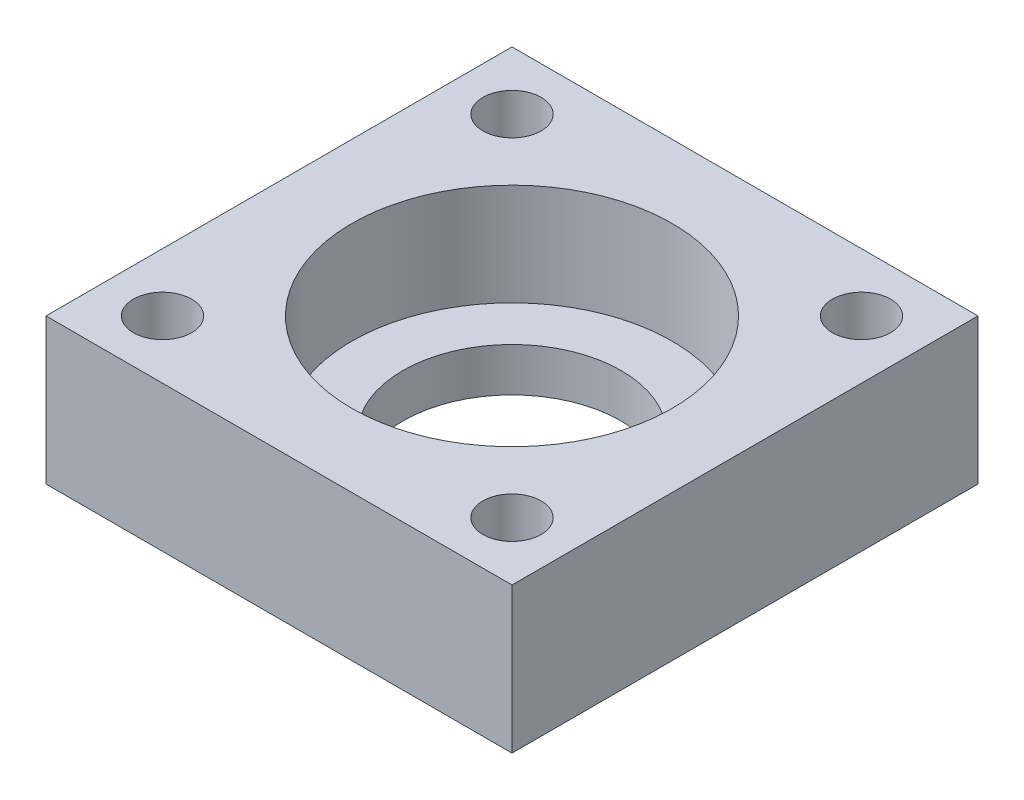
ISO-10303-21;
HEADER;
FILE_DESCRIPTION(('STEP AP214'),'2;1');
FILE_NAME('part.step','',(''),(''),'','','');
FILE_SCHEMA(('AUTOMOTIVE_DESIGN { 1 0 10303 214 1 1 1 1 }'));
ENDSEC;
DATA;
#1=APPLICATION_CONTEXT('core data for automotive mechanical design processes');
#2=APPLICATION_PROTOCOL_DEFINITION('international standard','automotive_design',2000,#1);
#3=PRODUCT_CONTEXT('',#1,'mechanical');
#4=PRODUCT('Part','Part','',(#3));
#5=PRODUCT_RELATED_PRODUCT_CATEGORY('part','',(#4));
#6=PRODUCT_DEFINITION_FORMATION('','',#4);
#7=PRODUCT_DEFINITION_CONTEXT('part definition',#1,'design');
#8=PRODUCT_DEFINITION('design','',#6,#7);
#9=PRODUCT_DEFINITION_SHAPE('','',#8);
#10=(LENGTH_UNIT() NAMED_UNIT(*) SI_UNIT(.MILLI.,.METRE.));
#11=(NAMED_UNIT(*) PLANE_ANGLE_UNIT() SI_UNIT($,.RADIAN.));
#12=(NAMED_UNIT(*) SI_UNIT($,.STERADIAN.) SOLID_ANGLE_UNIT());
#13=UNCERTAINTY_MEASURE_WITH_UNIT(LENGTH_MEASURE(1.E-05),#10,'distance_accuracy_value','');
#14=(GEOMETRIC_REPRESENTATION_CONTEXT(3) GLOBAL_UNCERTAINTY_ASSIGNED_CONTEXT((#13)) GLOBAL_UNIT_ASSIGNED_CONTEXT((#10,
#11,#12)) REPRESENTATION_CONTEXT('',''));
#15=CARTESIAN_POINT('',(0.,0.,0.));
#16=DIRECTION('',(0.,0.,1.));
#17=DIRECTION('',(1.,0.,0.));
#18=AXIS2_PLACEMENT_3D('',#15,#16,#17);
#19=CARTESIAN_POINT('',(16.,10.,16.));
#20=DIRECTION('',(-1.,0.,0.));
#21=DIRECTION('',(0.,0.,1.));
#22=AXIS2_PLACEMENT_3D('',#19,#20,#21);
#23=PLANE('',#22);
#24=DIRECTION('',(0.,0.,-1.));
#25=VECTOR('',#24,1.);
#26=CARTESIAN_POINT('',(16.,0.,16.));
#27=LINE('',#26,#25);
#28=CARTESIAN_POINT('',(16.,0.,16.));
#29=VERTEX_POINT('',#28);
#30=CARTESIAN_POINT('',(16.,0.,-16.));
#31=VERTEX_POINT('',#30);
#32=EDGE_CURVE('E109',#29,#31,#27,.T.);
#33=ORIENTED_EDGE('',*,*,#32,.T.);
#34=DIRECTION('',(0.,-1.,0.));
#35=VECTOR('',#34,1.);
#36=CARTESIAN_POINT('',(16.,10.,-16.));
#37=LINE('',#36,#35);
#38=CARTESIAN_POINT('',(16.,10.,-16.));
#39=VERTEX_POINT('',#38);
#40=EDGE_CURVE('E11',#39,#31,#37,.T.);
#41=ORIENTED_EDGE('',*,*,#40,.F.);
#42=DIRECTION('',(0.,0.,-1.));
#43=VECTOR('',#42,1.);
#44=CARTESIAN_POINT('',(16.,10.,16.));
#45=LINE('',#44,#43);
#46=CARTESIAN_POINT('',(16.,10.,16.));
#47=VERTEX_POINT('',#46);
#48=EDGE_CURVE('E92',#47,#39,#45,.T.);
#49=ORIENTED_EDGE('',*,*,#48,.F.);
#50=DIRECTION('',(0.,-1.,0.));
#51=VECTOR('',#50,1.);
#52=CARTESIAN_POINT('',(16.,10.,16.));
#53=LINE('',#52,#51);
#54=EDGE_CURVE('E105',#47,#29,#53,.T.);
#55=ORIENTED_EDGE('',*,*,#54,.T.);
#56=EDGE_LOOP('',(#33,#41,#49,#55));
#57=FACE_BOUND('',#56,.T.);
#58=ADVANCED_FACE('F39',(#57),#23,.F.);
#59=CARTESIAN_POINT('',(-16.,10.,-16.));
#60=DIRECTION('',(0.,0.,1.));
#61=DIRECTION('',(1.,0.,0.));
#62=AXIS2_PLACEMENT_3D('',#59,#60,#61);
#63=PLANE('',#62);
#64=DIRECTION('',(-1.,0.,0.));
#65=VECTOR('',#64,1.);
#66=CARTESIAN_POINT('',(-16.,0.,-16.));
#67=LINE('',#66,#65);
#68=CARTESIAN_POINT('',(-16.,0.,-16.));
#69=VERTEX_POINT('',#68);
#70=EDGE_CURVE('E97',#31,#69,#67,.T.);
#71=ORIENTED_EDGE('',*,*,#70,.T.);
#72=DIRECTION('',(0.,-1.,0.));
#73=VECTOR('',#72,1.);
#74=CARTESIAN_POINT('',(-16.,10.,-16.));
#75=LINE('',#74,#73);
#76=CARTESIAN_POINT('',(-16.,10.,-16.));
#77=VERTEX_POINT('',#76);
#78=EDGE_CURVE('E49',#77,#69,#75,.T.);
#79=ORIENTED_EDGE('',*,*,#78,.F.);
#80=DIRECTION('',(-1.,0.,0.));
#81=VECTOR('',#80,1.);
#82=CARTESIAN_POINT('',(-16.,10.,-16.));
#83=LINE('',#82,#81);
#84=EDGE_CURVE('E87',#39,#77,#83,.T.);
#85=ORIENTED_EDGE('',*,*,#84,.F.);
#86=ORIENTED_EDGE('',*,*,#40,.T.);
#87=EDGE_LOOP('',(#71,#79,#85,#86));
#88=FACE_BOUND('',#87,.T.);
#89=ADVANCED_FACE('F96',(#88),#63,.F.);
#90=CARTESIAN_POINT('',(-16.,10.,16.));
#91=DIRECTION('',(1.,0.,0.));
#92=DIRECTION('',(0.,0.,-1.));
#93=AXIS2_PLACEMENT_3D('',#90,#91,#92);
#94=PLANE('',#93);
#95=DIRECTION('',(0.,0.,1.));
#96=VECTOR('',#95,1.);
#97=CARTESIAN_POINT('',(-16.,0.,16.));
#98=LINE('',#97,#96);
#99=CARTESIAN_POINT('',(-16.,0.,16.));
#100=VERTEX_POINT('',#99);
#101=EDGE_CURVE('E74',#69,#100,#98,.T.);
#102=ORIENTED_EDGE('',*,*,#101,.T.);
#103=DIRECTION('',(0.,-1.,0.));
#104=VECTOR('',#103,1.);
#105=CARTESIAN_POINT('',(-16.,10.,16.));
#106=LINE('',#105,#104);
#107=CARTESIAN_POINT('',(-16.,10.,16.));
#108=VERTEX_POINT('',#107);
#109=EDGE_CURVE('E99',#108,#100,#106,.T.);
#110=ORIENTED_EDGE('',*,*,#109,.F.);
#111=DIRECTION('',(0.,0.,1.));
#112=VECTOR('',#111,1.);
#113=CARTESIAN_POINT('',(-16.,10.,16.));
#114=LINE('',#113,#112);
#115=EDGE_CURVE('E90',#77,#108,#114,.T.);
#116=ORIENTED_EDGE('',*,*,#115,.F.);
#117=ORIENTED_EDGE('',*,*,#78,.T.);
#118=EDGE_LOOP('',(#102,#110,#116,#117));
#119=FACE_BOUND('',#118,.T.);
#120=ADVANCED_FACE('F101',(#119),#94,.F.);
#121=CARTESIAN_POINT('',(-16.,10.,16.));
#122=DIRECTION('',(0.,0.,-1.));
#123=DIRECTION('',(-1.,0.,0.));
#124=AXIS2_PLACEMENT_3D('',#121,#122,#123);
#125=PLANE('',#124);
#126=DIRECTION('',(1.,0.,0.));
#127=VECTOR('',#126,1.);
#128=CARTESIAN_POINT('',(-16.,0.,16.));
#129=LINE('',#128,#127);
#130=EDGE_CURVE('E80',#100,#29,#129,.T.);
#131=ORIENTED_EDGE('',*,*,#130,.T.);
#132=ORIENTED_EDGE('',*,*,#54,.F.);
#133=DIRECTION('',(1.,0.,0.));
#134=VECTOR('',#133,1.);
#135=CARTESIAN_POINT('',(-16.,10.,16.));
#136=LINE('',#135,#134);
#137=EDGE_CURVE('E57',#108,#47,#136,.T.);
#138=ORIENTED_EDGE('',*,*,#137,.F.);
#139=ORIENTED_EDGE('',*,*,#109,.T.);
#140=EDGE_LOOP('',(#131,#132,#138,#139));
#141=FACE_BOUND('',#140,.T.);
#142=ADVANCED_FACE('F123',(#141),#125,.F.);
#143=CARTESIAN_POINT('',(0.,10.,0.));
#144=DIRECTION('',(0.,-1.,0.));
#145=DIRECTION('',(0.,0.,-1.));
#146=AXIS2_PLACEMENT_3D('',#143,#144,#145);
#147=PLANE('',#146);
#148=CARTESIAN_POINT('',(-12.,10.,12.));
#149=DIRECTION('',(0.,1.,0.));
#150=DIRECTION('',(0.,0.,-1.));
#151=AXIS2_PLACEMENT_3D('',#148,#149,#150);
#152=CIRCLE('',#151,2.);
#153=CARTESIAN_POINT('',(-12.,10.,10.));
#154=VERTEX_POINT('',#153);
#155=EDGE_CURVE('E150',#154,#154,#152,.T.);
#156=ORIENTED_EDGE('',*,*,#155,.F.);
#157=EDGE_LOOP('',(#156));
#158=FACE_BOUND('',#157,.T.);
#159=CARTESIAN_POINT('',(12.,10.,12.));
#160=DIRECTION('',(0.,1.,0.));
#161=DIRECTION('',(0.,0.,1.));
#162=AXIS2_PLACEMENT_3D('',#159,#160,#161);
#163=CIRCLE('',#162,2.);
#164=CARTESIAN_POINT('',(12.,10.,14.));
#165=VERTEX_POINT('',#164);
#166=EDGE_CURVE('E158',#165,#165,#163,.T.);
#167=ORIENTED_EDGE('',*,*,#166,.F.);
#168=EDGE_LOOP('',(#167));
#169=FACE_BOUND('',#168,.T.);
#170=CARTESIAN_POINT('',(12.,10.,-12.));
#171=DIRECTION('',(0.,1.,0.));
#172=DIRECTION('',(0.,0.,-1.));
#173=AXIS2_PLACEMENT_3D('',#170,#171,#172);
#174=CIRCLE('',#173,2.);
#175=CARTESIAN_POINT('',(12.,10.,-14.));
#176=VERTEX_POINT('',#175);
#177=EDGE_CURVE('E166',#176,#176,#174,.T.);
#178=ORIENTED_EDGE('',*,*,#177,.F.);
#179=EDGE_LOOP('',(#178));
#180=FACE_BOUND('',#179,.T.);
#181=CARTESIAN_POINT('',(-12.,10.,-12.));
#182=DIRECTION('',(0.,1.,0.));
#183=DIRECTION('',(0.,0.,1.));
#184=AXIS2_PLACEMENT_3D('',#181,#182,#183);
#185=CIRCLE('',#184,2.);
#186=CARTESIAN_POINT('',(-12.,10.,-10.));
#187=VERTEX_POINT('',#186);
#188=EDGE_CURVE('E137',#187,#187,#185,.T.);
#189=ORIENTED_EDGE('',*,*,#188,.F.);
#190=EDGE_LOOP('',(#189));
#191=FACE_BOUND('',#190,.T.);
#192=CARTESIAN_POINT('',(0.,10.,0.));
#193=DIRECTION('',(0.,1.,0.));
#194=DIRECTION('',(0.,0.,1.));
#195=AXIS2_PLACEMENT_3D('',#192,#193,#194);
#196=CIRCLE('',#195,11.);
#197=CARTESIAN_POINT('',(0.,10.,11.));
#198=VERTEX_POINT('',#197);
#199=EDGE_CURVE('E130',#198,#198,#196,.T.);
#200=ORIENTED_EDGE('',*,*,#199,.F.);
#201=EDGE_LOOP('',(#200));
#202=FACE_BOUND('',#201,.T.);
#203=ORIENTED_EDGE('',*,*,#48,.T.);
#204=ORIENTED_EDGE('',*,*,#84,.T.);
#205=ORIENTED_EDGE('',*,*,#115,.T.);
#206=ORIENTED_EDGE('',*,*,#137,.T.);
#207=EDGE_LOOP('',(#203,#204,#205,#206));
#208=FACE_BOUND('',#207,.T.);
#209=ADVANCED_FACE('F88',(#158,#169,#180,#191,#202,#208),#147,.F.);
#210=CARTESIAN_POINT('',(0.,0.,0.));
#211=DIRECTION('',(0.,-1.,0.));
#212=DIRECTION('',(0.,0.,-1.));
#213=AXIS2_PLACEMENT_3D('',#210,#211,#212);
#214=PLANE('',#213);
#215=CARTESIAN_POINT('',(0.,0.,0.));
#216=DIRECTION('',(0.,1.,0.));
#217=DIRECTION('',(0.,0.,1.));
#218=AXIS2_PLACEMENT_3D('',#215,#216,#217);
#219=CIRCLE('',#218,7.5);
#220=CARTESIAN_POINT('',(0.,0.,7.5));
#221=VERTEX_POINT('',#220);
#222=EDGE_CURVE('E146',#221,#221,#219,.T.);
#223=ORIENTED_EDGE('',*,*,#222,.T.);
#224=EDGE_LOOP('',(#223));
#225=FACE_BOUND('',#224,.T.);
#226=CARTESIAN_POINT('',(-12.,0.,12.));
#227=DIRECTION('',(0.,1.,0.));
#228=DIRECTION('',(0.,0.,-1.));
#229=AXIS2_PLACEMENT_3D('',#226,#227,#228);
#230=CIRCLE('',#229,2.);
#231=CARTESIAN_POINT('',(-12.,0.,10.));
#232=VERTEX_POINT('',#231);
#233=EDGE_CURVE('E154',#232,#232,#230,.T.);
#234=ORIENTED_EDGE('',*,*,#233,.T.);
#235=EDGE_LOOP('',(#234));
#236=FACE_BOUND('',#235,.T.);
#237=CARTESIAN_POINT('',(12.,0.,12.));
#238=DIRECTION('',(0.,1.,0.));
#239=DIRECTION('',(0.,0.,1.));
#240=AXIS2_PLACEMENT_3D('',#237,#238,#239);
#241=CIRCLE('',#240,2.);
#242=CARTESIAN_POINT('',(12.,0.,14.));
#243=VERTEX_POINT('',#242);
#244=EDGE_CURVE('E162',#243,#243,#241,.T.);
#245=ORIENTED_EDGE('',*,*,#244,.T.);
#246=EDGE_LOOP('',(#245));
#247=FACE_BOUND('',#246,.T.);
#248=CARTESIAN_POINT('',(12.,0.,-12.));
#249=DIRECTION('',(0.,1.,0.));
#250=DIRECTION('',(0.,0.,-1.));
#251=AXIS2_PLACEMENT_3D('',#248,#249,#250);
#252=CIRCLE('',#251,2.);
#253=CARTESIAN_POINT('',(12.,0.,-14.));
#254=VERTEX_POINT('',#253);
#255=EDGE_CURVE('E142',#254,#254,#252,.T.);
#256=ORIENTED_EDGE('',*,*,#255,.T.);
#257=EDGE_LOOP('',(#256));
#258=FACE_BOUND('',#257,.T.);
#259=CARTESIAN_POINT('',(-12.,0.,-12.));
#260=DIRECTION('',(0.,1.,0.));
#261=DIRECTION('',(0.,0.,1.));
#262=AXIS2_PLACEMENT_3D('',#259,#260,#261);
#263=CIRCLE('',#262,2.);
#264=CARTESIAN_POINT('',(-12.,0.,-10.));
#265=VERTEX_POINT('',#264);
#266=EDGE_CURVE('E141',#265,#265,#263,.T.);
#267=ORIENTED_EDGE('',*,*,#266,.T.);
#268=EDGE_LOOP('',(#267));
#269=FACE_BOUND('',#268,.T.);
#270=ORIENTED_EDGE('',*,*,#32,.F.);
#271=ORIENTED_EDGE('',*,*,#130,.F.);
#272=ORIENTED_EDGE('',*,*,#101,.F.);
#273=ORIENTED_EDGE('',*,*,#70,.F.);
#274=EDGE_LOOP('',(#270,#271,#272,#273));
#275=FACE_BOUND('',#274,.T.);
#276=ADVANCED_FACE('F126',(#225,#236,#247,#258,#269,#275),#214,.T.);
#277=CARTESIAN_POINT('',(0.,3.,0.));
#278=DIRECTION('',(0.,1.,0.));
#279=DIRECTION('',(0.,0.,1.));
#280=AXIS2_PLACEMENT_3D('',#277,#278,#279);
#281=CYLINDRICAL_SURFACE('',#280,11.);
#282=CARTESIAN_POINT('',(0.,3.,0.));
#283=DIRECTION('',(0.,1.,0.));
#284=DIRECTION('',(0.,0.,1.));
#285=AXIS2_PLACEMENT_3D('',#282,#283,#284);
#286=CIRCLE('',#285,11.);
#287=CARTESIAN_POINT('',(0.,3.,11.));
#288=VERTEX_POINT('',#287);
#289=EDGE_CURVE('E113',#288,#288,#286,.T.);
#290=ORIENTED_EDGE('',*,*,#289,.F.);
#291=EDGE_LOOP('',(#290));
#292=FACE_BOUND('',#291,.T.);
#293=ORIENTED_EDGE('',*,*,#199,.T.);
#294=EDGE_LOOP('',(#293));
#295=FACE_BOUND('',#294,.T.);
#296=ADVANCED_FACE('F192',(#292,#295),#281,.F.);
#297=CARTESIAN_POINT('',(0.,3.,0.));
#298=DIRECTION('',(0.,1.,0.));
#299=DIRECTION('',(0.,0.,1.));
#300=AXIS2_PLACEMENT_3D('',#297,#298,#299);
#301=PLANE('',#300);
#302=CARTESIAN_POINT('',(0.,3.,0.));
#303=DIRECTION('',(0.,1.,0.));
#304=DIRECTION('',(0.,0.,1.));
#305=AXIS2_PLACEMENT_3D('',#302,#303,#304);
#306=CIRCLE('',#305,7.5);
#307=CARTESIAN_POINT('',(0.,3.,7.5));
#308=VERTEX_POINT('',#307);
#309=EDGE_CURVE('E42',#308,#308,#306,.T.);
#310=ORIENTED_EDGE('',*,*,#309,.F.);
#311=EDGE_LOOP('',(#310));
#312=FACE_BOUND('',#311,.T.);
#313=ORIENTED_EDGE('',*,*,#289,.T.);
#314=EDGE_LOOP('',(#313));
#315=FACE_BOUND('',#314,.T.);
#316=ADVANCED_FACE('F194',(#312,#315),#301,.T.);
#317=CARTESIAN_POINT('',(0.,0.,0.));
#318=DIRECTION('',(0.,1.,0.));
#319=DIRECTION('',(0.,0.,1.));
#320=AXIS2_PLACEMENT_3D('',#317,#318,#319);
#321=CYLINDRICAL_SURFACE('',#320,7.5);
#322=ORIENTED_EDGE('',*,*,#309,.T.);
#323=EDGE_LOOP('',(#322));
#324=FACE_BOUND('',#323,.T.);
#325=ORIENTED_EDGE('',*,*,#222,.F.);
#326=EDGE_LOOP('',(#325));
#327=FACE_BOUND('',#326,.T.);
#328=ADVANCED_FACE('F201',(#324,#327),#321,.F.);
#329=CARTESIAN_POINT('',(-12.,0.,-12.));
#330=DIRECTION('',(0.,1.,0.));
#331=DIRECTION('',(0.,0.,1.));
#332=AXIS2_PLACEMENT_3D('',#329,#330,#331);
#333=CYLINDRICAL_SURFACE('',#332,2.);
#334=ORIENTED_EDGE('',*,*,#266,.F.);
#335=EDGE_LOOP('',(#334));
#336=FACE_BOUND('',#335,.T.);
#337=ORIENTED_EDGE('',*,*,#188,.T.);
#338=EDGE_LOOP('',(#337));
#339=FACE_BOUND('',#338,.T.);
#340=ADVANCED_FACE('F180',(#336,#339),#333,.F.);
#341=CARTESIAN_POINT('',(12.,0.,-12.));
#342=DIRECTION('',(0.,1.,0.));
#343=DIRECTION('',(0.,0.,1.));
#344=AXIS2_PLACEMENT_3D('',#341,#342,#343);
#345=CYLINDRICAL_SURFACE('',#344,2.);
#346=ORIENTED_EDGE('',*,*,#255,.F.);
#347=EDGE_LOOP('',(#346));
#348=FACE_BOUND('',#347,.T.);
#349=ORIENTED_EDGE('',*,*,#177,.T.);
#350=EDGE_LOOP('',(#349));
#351=FACE_BOUND('',#350,.T.);
#352=ADVANCED_FACE('F176',(#348,#351),#345,.F.);
#353=CARTESIAN_POINT('',(12.,0.,12.));
#354=DIRECTION('',(0.,1.,0.));
#355=DIRECTION('',(0.,0.,1.));
#356=AXIS2_PLACEMENT_3D('',#353,#354,#355);
#357=CYLINDRICAL_SURFACE('',#356,2.);
#358=ORIENTED_EDGE('',*,*,#244,.F.);
#359=EDGE_LOOP('',(#358));
#360=FACE_BOUND('',#359,.T.);
#361=ORIENTED_EDGE('',*,*,#166,.T.);
#362=EDGE_LOOP('',(#361));
#363=FACE_BOUND('',#362,.T.);
#364=ADVANCED_FACE('F179',(#360,#363),#357,.F.);
#365=CARTESIAN_POINT('',(-12.,0.,12.));
#366=DIRECTION('',(0.,1.,0.));
#367=DIRECTION('',(0.,0.,1.));
#368=AXIS2_PLACEMENT_3D('',#365,#366,#367);
#369=CYLINDRICAL_SURFACE('',#368,2.);
#370=ORIENTED_EDGE('',*,*,#233,.F.);
#371=EDGE_LOOP('',(#370));
#372=FACE_BOUND('',#371,.T.);
#373=ORIENTED_EDGE('',*,*,#155,.T.);
#374=EDGE_LOOP('',(#373));
#375=FACE_BOUND('',#374,.T.);
#376=ADVANCED_FACE('F269',(#372,#375),#369,.F.);
#377=CLOSED_SHELL('',(#58,#89,#120,#142,#209,#276,#296,#316,#328,#340,#352,#364,#376));
#378=MANIFOLD_SOLID_BREP('B2',#377);
#379=ADVANCED_BREP_SHAPE_REPRESENTATION('',(#18,#378),#14);
#380=SHAPE_DEFINITION_REPRESENTATION(#9,#379);
ENDSEC;
END-ISO-10303-21;
